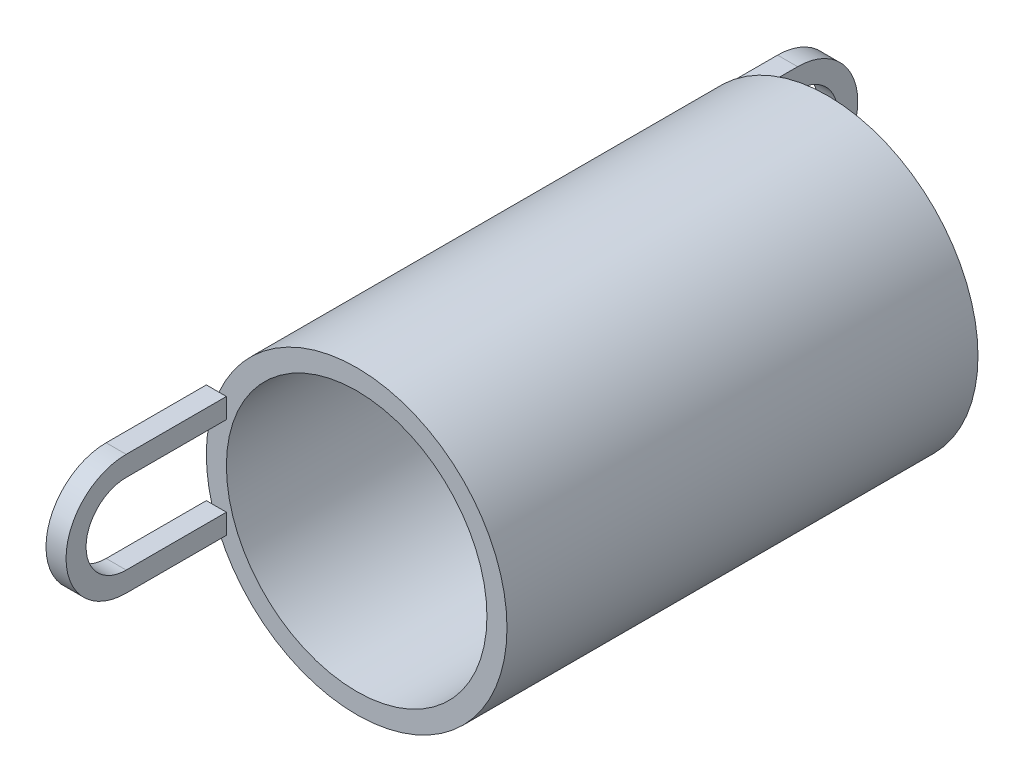
ISO-10303-21;
HEADER;
FILE_DESCRIPTION(('STEP AP214'),'2;1');
FILE_NAME('part.step','',(''),(''),'','','');
FILE_SCHEMA(('AUTOMOTIVE_DESIGN { 1 0 10303 214 1 1 1 1 }'));
ENDSEC;
DATA;
#1=APPLICATION_CONTEXT('core data for automotive mechanical design processes');
#2=APPLICATION_PROTOCOL_DEFINITION('international standard','automotive_design',2000,#1);
#3=PRODUCT_CONTEXT('',#1,'mechanical');
#4=PRODUCT('Part','Part','',(#3));
#5=PRODUCT_RELATED_PRODUCT_CATEGORY('part','',(#4));
#6=PRODUCT_DEFINITION_FORMATION('','',#4);
#7=PRODUCT_DEFINITION_CONTEXT('part definition',#1,'design');
#8=PRODUCT_DEFINITION('design','',#6,#7);
#9=PRODUCT_DEFINITION_SHAPE('','',#8);
#10=(LENGTH_UNIT() NAMED_UNIT(*) SI_UNIT(.MILLI.,.METRE.));
#11=(NAMED_UNIT(*) PLANE_ANGLE_UNIT() SI_UNIT($,.RADIAN.));
#12=(NAMED_UNIT(*) SI_UNIT($,.STERADIAN.) SOLID_ANGLE_UNIT());
#13=UNCERTAINTY_MEASURE_WITH_UNIT(LENGTH_MEASURE(1.E-05),#10,'distance_accuracy_value','');
#14=(GEOMETRIC_REPRESENTATION_CONTEXT(3) GLOBAL_UNCERTAINTY_ASSIGNED_CONTEXT((#13)) GLOBAL_UNIT_ASSIGNED_CONTEXT((#10,
#11,#12)) REPRESENTATION_CONTEXT('',''));
#15=CARTESIAN_POINT('',(0.,0.,0.));
#16=DIRECTION('',(0.,0.,1.));
#17=DIRECTION('',(1.,0.,0.));
#18=AXIS2_PLACEMENT_3D('',#15,#16,#17);
#19=CARTESIAN_POINT('',(0.,0.,23.5));
#20=DIRECTION('',(0.,0.,1.));
#21=DIRECTION('',(1.,0.,0.));
#22=AXIS2_PLACEMENT_3D('',#19,#20,#21);
#23=PLANE('',#22);
#24=CARTESIAN_POINT('',(0.,0.,23.5));
#25=DIRECTION('',(0.,0.,1.));
#26=DIRECTION('',(1.,0.,0.));
#27=AXIS2_PLACEMENT_3D('',#24,#25,#26);
#28=CIRCLE('',#27,6.5);
#29=CARTESIAN_POINT('',(6.5,0.,23.5));
#30=VERTEX_POINT('',#29);
#31=EDGE_CURVE('E268',#30,#30,#28,.T.);
#32=ORIENTED_EDGE('',*,*,#31,.F.);
#33=EDGE_LOOP('',(#32));
#34=FACE_BOUND('',#33,.T.);
#35=DIRECTION('',(0.,1.,0.));
#36=VECTOR('',#35,1.);
#37=CARTESIAN_POINT('',(-6.5,1.99999999999999,23.5));
#38=LINE('',#37,#36);
#39=CARTESIAN_POINT('',(-6.5,2.,23.5));
#40=VERTEX_POINT('',#39);
#41=CARTESIAN_POINT('',(-6.5,3.,23.5));
#42=VERTEX_POINT('',#41);
#43=EDGE_CURVE('E49',#40,#42,#38,.T.);
#44=ORIENTED_EDGE('',*,*,#43,.F.);
#45=DIRECTION('',(-1.,0.,0.));
#46=VECTOR('',#45,1.);
#47=CARTESIAN_POINT('',(-6.5,1.99999999999999,23.5));
#48=LINE('',#47,#46);
#49=CARTESIAN_POINT('',(-7.22841614740048,1.99999999999999,23.5));
#50=VERTEX_POINT('',#49);
#51=EDGE_CURVE('E527',#40,#50,#48,.T.);
#52=ORIENTED_EDGE('',*,*,#51,.T.);
#53=CARTESIAN_POINT('',(0.,0.,23.5));
#54=DIRECTION('',(0.,0.,1.));
#55=DIRECTION('',(1.,0.,0.));
#56=AXIS2_PLACEMENT_3D('',#53,#54,#55);
#57=CIRCLE('',#56,7.5);
#58=CARTESIAN_POINT('',(-7.22841614740048,-2.,23.5));
#59=VERTEX_POINT('',#58);
#60=EDGE_CURVE('E41',#50,#59,#57,.T.);
#61=ORIENTED_EDGE('',*,*,#60,.T.);
#62=DIRECTION('',(-1.,0.,0.));
#63=VECTOR('',#62,1.);
#64=CARTESIAN_POINT('',(-6.5,-2.,23.5));
#65=LINE('',#64,#63);
#66=CARTESIAN_POINT('',(-6.5,-2.,23.5));
#67=VERTEX_POINT('',#66);
#68=EDGE_CURVE('E535',#67,#59,#65,.T.);
#69=ORIENTED_EDGE('',*,*,#68,.F.);
#70=DIRECTION('',(0.,1.,0.));
#71=VECTOR('',#70,1.);
#72=CARTESIAN_POINT('',(-6.5,-3.00000000000001,23.5));
#73=LINE('',#72,#71);
#74=CARTESIAN_POINT('',(-6.5,-3.00000000000001,23.5));
#75=VERTEX_POINT('',#74);
#76=EDGE_CURVE('E183',#75,#67,#73,.T.);
#77=ORIENTED_EDGE('',*,*,#76,.F.);
#78=DIRECTION('',(-1.,0.,0.));
#79=VECTOR('',#78,1.);
#80=CARTESIAN_POINT('',(-6.5,-3.00000000000001,23.5));
#81=LINE('',#80,#79);
#82=CARTESIAN_POINT('',(-6.87386354243376,-3.00000000000001,23.5));
#83=VERTEX_POINT('',#82);
#84=EDGE_CURVE('E180',#75,#83,#81,.T.);
#85=ORIENTED_EDGE('',*,*,#84,.T.);
#86=CARTESIAN_POINT('',(-6.87386354243376,3.,23.5));
#87=VERTEX_POINT('',#86);
#88=EDGE_CURVE('E42',#83,#87,#57,.T.);
#89=ORIENTED_EDGE('',*,*,#88,.T.);
#90=DIRECTION('',(-1.,0.,0.));
#91=VECTOR('',#90,1.);
#92=CARTESIAN_POINT('',(-6.5,3.,23.5));
#93=LINE('',#92,#91);
#94=EDGE_CURVE('E54',#42,#87,#93,.T.);
#95=ORIENTED_EDGE('',*,*,#94,.F.);
#96=EDGE_LOOP('',(#44,#52,#61,#69,#77,#85,#89,#95));
#97=FACE_BOUND('',#96,.T.);
#98=ADVANCED_FACE('F32',(#34,#97),#23,.T.);
#99=CARTESIAN_POINT('',(0.,0.,0.));
#100=DIRECTION('',(0.,0.,1.));
#101=DIRECTION('',(1.,0.,0.));
#102=AXIS2_PLACEMENT_3D('',#99,#100,#101);
#103=PLANE('',#102);
#104=CARTESIAN_POINT('',(0.,0.,0.));
#105=DIRECTION('',(0.,0.,1.));
#106=DIRECTION('',(1.,0.,0.));
#107=AXIS2_PLACEMENT_3D('',#104,#105,#106);
#108=CIRCLE('',#107,6.5);
#109=CARTESIAN_POINT('',(6.5,0.,0.));
#110=VERTEX_POINT('',#109);
#111=EDGE_CURVE('E267',#110,#110,#108,.T.);
#112=ORIENTED_EDGE('',*,*,#111,.T.);
#113=EDGE_LOOP('',(#112));
#114=FACE_BOUND('',#113,.T.);
#115=DIRECTION('',(-1.,0.,0.));
#116=VECTOR('',#115,1.);
#117=CARTESIAN_POINT('',(-6.5,-2.,0.));
#118=LINE('',#117,#116);
#119=CARTESIAN_POINT('',(-6.5,-2.,0.));
#120=VERTEX_POINT('',#119);
#121=CARTESIAN_POINT('',(-7.22841614740048,-2.,0.));
#122=VERTEX_POINT('',#121);
#123=EDGE_CURVE('E261',#120,#122,#118,.T.);
#124=ORIENTED_EDGE('',*,*,#123,.T.);
#125=CARTESIAN_POINT('',(0.,0.,0.));
#126=DIRECTION('',(0.,0.,1.));
#127=DIRECTION('',(1.,0.,0.));
#128=AXIS2_PLACEMENT_3D('',#125,#126,#127);
#129=CIRCLE('',#128,7.5);
#130=CARTESIAN_POINT('',(-7.22841614740048,2.,0.));
#131=VERTEX_POINT('',#130);
#132=EDGE_CURVE('E560',#131,#122,#129,.T.);
#133=ORIENTED_EDGE('',*,*,#132,.F.);
#134=DIRECTION('',(-1.,0.,0.));
#135=VECTOR('',#134,1.);
#136=CARTESIAN_POINT('',(-6.5,2.,0.));
#137=LINE('',#136,#135);
#138=CARTESIAN_POINT('',(-6.5,2.,0.));
#139=VERTEX_POINT('',#138);
#140=EDGE_CURVE('E245',#139,#131,#137,.T.);
#141=ORIENTED_EDGE('',*,*,#140,.F.);
#142=DIRECTION('',(0.,-1.,0.));
#143=VECTOR('',#142,1.);
#144=CARTESIAN_POINT('',(-6.5,3.,0.));
#145=LINE('',#144,#143);
#146=CARTESIAN_POINT('',(-6.5,3.,0.));
#147=VERTEX_POINT('',#146);
#148=EDGE_CURVE('E221',#147,#139,#145,.T.);
#149=ORIENTED_EDGE('',*,*,#148,.F.);
#150=DIRECTION('',(-1.,0.,0.));
#151=VECTOR('',#150,1.);
#152=CARTESIAN_POINT('',(-6.5,3.,0.));
#153=LINE('',#152,#151);
#154=CARTESIAN_POINT('',(-6.87386354243376,3.,0.));
#155=VERTEX_POINT('',#154);
#156=EDGE_CURVE('E248',#147,#155,#153,.T.);
#157=ORIENTED_EDGE('',*,*,#156,.T.);
#158=CARTESIAN_POINT('',(-6.87386354243376,-3.,0.));
#159=VERTEX_POINT('',#158);
#160=EDGE_CURVE('E271',#159,#155,#129,.T.);
#161=ORIENTED_EDGE('',*,*,#160,.F.);
#162=DIRECTION('',(-1.,0.,0.));
#163=VECTOR('',#162,1.);
#164=CARTESIAN_POINT('',(-6.5,-3.,0.));
#165=LINE('',#164,#163);
#166=CARTESIAN_POINT('',(-6.5,-3.,0.));
#167=VERTEX_POINT('',#166);
#168=EDGE_CURVE('E258',#167,#159,#165,.T.);
#169=ORIENTED_EDGE('',*,*,#168,.F.);
#170=DIRECTION('',(0.,-1.,0.));
#171=VECTOR('',#170,1.);
#172=CARTESIAN_POINT('',(-6.5,-3.,0.));
#173=LINE('',#172,#171);
#174=EDGE_CURVE('E213',#120,#167,#173,.T.);
#175=ORIENTED_EDGE('',*,*,#174,.F.);
#176=EDGE_LOOP('',(#124,#133,#141,#149,#157,#161,#169,#175));
#177=FACE_BOUND('',#176,.T.);
#178=ADVANCED_FACE('F275',(#114,#177),#103,.F.);
#179=CARTESIAN_POINT('',(0.,0.,23.5));
#180=DIRECTION('',(0.,0.,-1.));
#181=DIRECTION('',(-1.,0.,0.));
#182=AXIS2_PLACEMENT_3D('',#179,#180,#181);
#183=CYLINDRICAL_SURFACE('',#182,7.5);
#184=EDGE_CURVE('E11',#87,#50,#57,.T.);
#185=ORIENTED_EDGE('',*,*,#184,.F.);
#186=ORIENTED_EDGE('',*,*,#88,.F.);
#187=EDGE_CURVE('E558',#59,#83,#57,.T.);
#188=ORIENTED_EDGE('',*,*,#187,.F.);
#189=ORIENTED_EDGE('',*,*,#60,.F.);
#190=EDGE_LOOP('',(#185,#186,#188,#189));
#191=FACE_BOUND('',#190,.T.);
#192=EDGE_CURVE('E36',#155,#131,#129,.T.);
#193=ORIENTED_EDGE('',*,*,#192,.T.);
#194=ORIENTED_EDGE('',*,*,#132,.T.);
#195=EDGE_CURVE('E564',#122,#159,#129,.T.);
#196=ORIENTED_EDGE('',*,*,#195,.T.);
#197=ORIENTED_EDGE('',*,*,#160,.T.);
#198=EDGE_LOOP('',(#193,#194,#196,#197));
#199=FACE_BOUND('',#198,.T.);
#200=ADVANCED_FACE('F34',(#191,#199),#183,.T.);
#201=CARTESIAN_POINT('',(0.,0.,23.5));
#202=DIRECTION('',(0.,0.,-1.));
#203=DIRECTION('',(-1.,0.,0.));
#204=AXIS2_PLACEMENT_3D('',#201,#202,#203);
#205=CYLINDRICAL_SURFACE('',#204,6.5);
#206=ORIENTED_EDGE('',*,*,#31,.T.);
#207=EDGE_LOOP('',(#206));
#208=FACE_BOUND('',#207,.T.);
#209=ORIENTED_EDGE('',*,*,#111,.F.);
#210=EDGE_LOOP('',(#209));
#211=FACE_BOUND('',#210,.T.);
#212=ADVANCED_FACE('F278',(#208,#211),#205,.F.);
#213=CARTESIAN_POINT('',(-6.5,0.,-5.));
#214=DIRECTION('',(-1.,0.,0.));
#215=DIRECTION('',(0.,0.,1.));
#216=AXIS2_PLACEMENT_3D('',#213,#214,#215);
#217=CYLINDRICAL_SURFACE('',#216,2.);
#218=CARTESIAN_POINT('',(-7.5,0.,-5.));
#219=DIRECTION('',(-1.,0.,0.));
#220=DIRECTION('',(0.,0.,-1.));
#221=AXIS2_PLACEMENT_3D('',#218,#219,#220);
#222=CIRCLE('',#221,2.);
#223=CARTESIAN_POINT('',(-7.5,2.,-5.));
#224=VERTEX_POINT('',#223);
#225=CARTESIAN_POINT('',(-7.5,-2.,-5.));
#226=VERTEX_POINT('',#225);
#227=EDGE_CURVE('E198',#224,#226,#222,.T.);
#228=ORIENTED_EDGE('',*,*,#227,.T.);
#229=DIRECTION('',(-1.,0.,0.));
#230=VECTOR('',#229,1.);
#231=CARTESIAN_POINT('',(-6.5,-2.,-5.));
#232=LINE('',#231,#230);
#233=CARTESIAN_POINT('',(-6.5,-2.,-5.));
#234=VERTEX_POINT('',#233);
#235=EDGE_CURVE('E264',#234,#226,#232,.T.);
#236=ORIENTED_EDGE('',*,*,#235,.F.);
#237=CARTESIAN_POINT('',(-6.5,0.,-5.));
#238=DIRECTION('',(-1.,0.,0.));
#239=DIRECTION('',(0.,0.,-1.));
#240=AXIS2_PLACEMENT_3D('',#237,#238,#239);
#241=CIRCLE('',#240,2.);
#242=CARTESIAN_POINT('',(-6.5,2.,-5.));
#243=VERTEX_POINT('',#242);
#244=EDGE_CURVE('E207',#243,#234,#241,.T.);
#245=ORIENTED_EDGE('',*,*,#244,.F.);
#246=DIRECTION('',(-1.,0.,0.));
#247=VECTOR('',#246,1.);
#248=CARTESIAN_POINT('',(-6.5,2.,-5.));
#249=LINE('',#248,#247);
#250=EDGE_CURVE('E224',#243,#224,#249,.T.);
#251=ORIENTED_EDGE('',*,*,#250,.T.);
#252=EDGE_LOOP('',(#228,#236,#245,#251));
#253=FACE_BOUND('',#252,.T.);
#254=ADVANCED_FACE('F280',(#253),#217,.F.);
#255=CARTESIAN_POINT('',(-6.5,-2.,-5.));
#256=DIRECTION('',(0.,-1.,0.));
#257=DIRECTION('',(0.,0.,-1.));
#258=AXIS2_PLACEMENT_3D('',#255,#256,#257);
#259=PLANE('',#258);
#260=DIRECTION('',(0.,0.,1.));
#261=VECTOR('',#260,1.);
#262=CARTESIAN_POINT('',(-7.5,-2.,-5.));
#263=LINE('',#262,#261);
#264=CARTESIAN_POINT('',(-7.5,-2.,0.));
#265=VERTEX_POINT('',#264);
#266=EDGE_CURVE('E201',#226,#265,#263,.T.);
#267=ORIENTED_EDGE('',*,*,#266,.T.);
#268=EDGE_CURVE('E260',#122,#265,#118,.T.);
#269=ORIENTED_EDGE('',*,*,#268,.F.);
#270=ORIENTED_EDGE('',*,*,#123,.F.);
#271=DIRECTION('',(0.,0.,1.));
#272=VECTOR('',#271,1.);
#273=CARTESIAN_POINT('',(-6.5,-2.,-5.));
#274=LINE('',#273,#272);
#275=EDGE_CURVE('E210',#234,#120,#274,.T.);
#276=ORIENTED_EDGE('',*,*,#275,.F.);
#277=ORIENTED_EDGE('',*,*,#235,.T.);
#278=EDGE_LOOP('',(#267,#269,#270,#276,#277));
#279=FACE_BOUND('',#278,.T.);
#280=ADVANCED_FACE('F287',(#279),#259,.F.);
#281=CARTESIAN_POINT('',(-6.5,-3.,0.));
#282=DIRECTION('',(0.,0.,-1.));
#283=DIRECTION('',(0.,1.,0.));
#284=AXIS2_PLACEMENT_3D('',#281,#282,#283);
#285=PLANE('',#284);
#286=CARTESIAN_POINT('',(-7.5,-3.,0.));
#287=VERTEX_POINT('',#286);
#288=EDGE_CURVE('E257',#159,#287,#165,.T.);
#289=ORIENTED_EDGE('',*,*,#288,.F.);
#290=ORIENTED_EDGE('',*,*,#195,.F.);
#291=ORIENTED_EDGE('',*,*,#268,.T.);
#292=DIRECTION('',(0.,-1.,0.));
#293=VECTOR('',#292,1.);
#294=CARTESIAN_POINT('',(-7.5,-3.,0.));
#295=LINE('',#294,#293);
#296=EDGE_CURVE('E228',#265,#287,#295,.T.);
#297=ORIENTED_EDGE('',*,*,#296,.T.);
#298=EDGE_LOOP('',(#289,#290,#291,#297));
#299=FACE_BOUND('',#298,.T.);
#300=ADVANCED_FACE('F321',(#299),#285,.F.);
#301=CARTESIAN_POINT('',(-6.5,-3.,-5.));
#302=DIRECTION('',(0.,1.,0.));
#303=DIRECTION('',(0.,0.,1.));
#304=AXIS2_PLACEMENT_3D('',#301,#302,#303);
#305=PLANE('',#304);
#306=DIRECTION('',(0.,0.,-1.));
#307=VECTOR('',#306,1.);
#308=CARTESIAN_POINT('',(-7.5,-3.,-5.));
#309=LINE('',#308,#307);
#310=CARTESIAN_POINT('',(-7.5,-3.,-5.));
#311=VERTEX_POINT('',#310);
#312=EDGE_CURVE('E231',#287,#311,#309,.T.);
#313=ORIENTED_EDGE('',*,*,#312,.T.);
#314=DIRECTION('',(-1.,0.,0.));
#315=VECTOR('',#314,1.);
#316=CARTESIAN_POINT('',(-6.5,-3.,-5.));
#317=LINE('',#316,#315);
#318=CARTESIAN_POINT('',(-6.5,-3.,-5.));
#319=VERTEX_POINT('',#318);
#320=EDGE_CURVE('E254',#319,#311,#317,.T.);
#321=ORIENTED_EDGE('',*,*,#320,.F.);
#322=DIRECTION('',(0.,0.,-1.));
#323=VECTOR('',#322,1.);
#324=CARTESIAN_POINT('',(-6.5,-3.,-5.));
#325=LINE('',#324,#323);
#326=EDGE_CURVE('E215',#167,#319,#325,.T.);
#327=ORIENTED_EDGE('',*,*,#326,.F.);
#328=ORIENTED_EDGE('',*,*,#168,.T.);
#329=ORIENTED_EDGE('',*,*,#288,.T.);
#330=EDGE_LOOP('',(#313,#321,#327,#328,#329));
#331=FACE_BOUND('',#330,.T.);
#332=ADVANCED_FACE('F331',(#331),#305,.F.);
#333=CARTESIAN_POINT('',(-6.5,0.,-5.));
#334=DIRECTION('',(-1.,0.,0.));
#335=DIRECTION('',(0.,0.,1.));
#336=AXIS2_PLACEMENT_3D('',#333,#334,#335);
#337=CYLINDRICAL_SURFACE('',#336,3.);
#338=CARTESIAN_POINT('',(-7.5,0.,-5.));
#339=DIRECTION('',(1.,0.,0.));
#340=DIRECTION('',(0.,0.,-1.));
#341=AXIS2_PLACEMENT_3D('',#338,#339,#340);
#342=CIRCLE('',#341,3.);
#343=CARTESIAN_POINT('',(-7.5,3.,-5.));
#344=VERTEX_POINT('',#343);
#345=EDGE_CURVE('E233',#311,#344,#342,.T.);
#346=ORIENTED_EDGE('',*,*,#345,.T.);
#347=DIRECTION('',(-1.,0.,0.));
#348=VECTOR('',#347,1.);
#349=CARTESIAN_POINT('',(-6.5,3.,-5.));
#350=LINE('',#349,#348);
#351=CARTESIAN_POINT('',(-6.5,3.,-5.));
#352=VERTEX_POINT('',#351);
#353=EDGE_CURVE('E251',#352,#344,#350,.T.);
#354=ORIENTED_EDGE('',*,*,#353,.F.);
#355=CARTESIAN_POINT('',(-6.5,0.,-5.));
#356=DIRECTION('',(1.,0.,0.));
#357=DIRECTION('',(0.,0.,-1.));
#358=AXIS2_PLACEMENT_3D('',#355,#356,#357);
#359=CIRCLE('',#358,3.);
#360=EDGE_CURVE('E217',#319,#352,#359,.T.);
#361=ORIENTED_EDGE('',*,*,#360,.F.);
#362=ORIENTED_EDGE('',*,*,#320,.T.);
#363=EDGE_LOOP('',(#346,#354,#361,#362));
#364=FACE_BOUND('',#363,.T.);
#365=ADVANCED_FACE('F341',(#364),#337,.T.);
#366=CARTESIAN_POINT('',(-6.5,3.,-5.));
#367=DIRECTION('',(0.,-1.,0.));
#368=DIRECTION('',(0.,0.,-1.));
#369=AXIS2_PLACEMENT_3D('',#366,#367,#368);
#370=PLANE('',#369);
#371=DIRECTION('',(0.,0.,1.));
#372=VECTOR('',#371,1.);
#373=CARTESIAN_POINT('',(-7.5,3.,-5.));
#374=LINE('',#373,#372);
#375=CARTESIAN_POINT('',(-7.5,3.,0.));
#376=VERTEX_POINT('',#375);
#377=EDGE_CURVE('E235',#344,#376,#374,.T.);
#378=ORIENTED_EDGE('',*,*,#377,.T.);
#379=EDGE_CURVE('E247',#155,#376,#153,.T.);
#380=ORIENTED_EDGE('',*,*,#379,.F.);
#381=ORIENTED_EDGE('',*,*,#156,.F.);
#382=DIRECTION('',(0.,0.,1.));
#383=VECTOR('',#382,1.);
#384=CARTESIAN_POINT('',(-6.5,3.,-5.));
#385=LINE('',#384,#383);
#386=EDGE_CURVE('E219',#352,#147,#385,.T.);
#387=ORIENTED_EDGE('',*,*,#386,.F.);
#388=ORIENTED_EDGE('',*,*,#353,.T.);
#389=EDGE_LOOP('',(#378,#380,#381,#387,#388));
#390=FACE_BOUND('',#389,.T.);
#391=ADVANCED_FACE('F351',(#390),#370,.F.);
#392=CARTESIAN_POINT('',(-6.5,3.,0.));
#393=DIRECTION('',(0.,0.,-1.));
#394=DIRECTION('',(0.,1.,0.));
#395=AXIS2_PLACEMENT_3D('',#392,#393,#394);
#396=PLANE('',#395);
#397=CARTESIAN_POINT('',(-7.5,2.,0.));
#398=VERTEX_POINT('',#397);
#399=EDGE_CURVE('E244',#131,#398,#137,.T.);
#400=ORIENTED_EDGE('',*,*,#399,.F.);
#401=ORIENTED_EDGE('',*,*,#192,.F.);
#402=ORIENTED_EDGE('',*,*,#379,.T.);
#403=DIRECTION('',(0.,-1.,0.));
#404=VECTOR('',#403,1.);
#405=CARTESIAN_POINT('',(-7.5,3.,0.));
#406=LINE('',#405,#404);
#407=EDGE_CURVE('E238',#376,#398,#406,.T.);
#408=ORIENTED_EDGE('',*,*,#407,.T.);
#409=EDGE_LOOP('',(#400,#401,#402,#408));
#410=FACE_BOUND('',#409,.T.);
#411=ADVANCED_FACE('F361',(#410),#396,.F.);
#412=CARTESIAN_POINT('',(-6.5,2.,-5.));
#413=DIRECTION('',(0.,1.,0.));
#414=DIRECTION('',(0.,0.,1.));
#415=AXIS2_PLACEMENT_3D('',#412,#413,#414);
#416=PLANE('',#415);
#417=DIRECTION('',(0.,0.,-1.));
#418=VECTOR('',#417,1.);
#419=CARTESIAN_POINT('',(-7.5,2.,-5.));
#420=LINE('',#419,#418);
#421=EDGE_CURVE('E211',#398,#224,#420,.T.);
#422=ORIENTED_EDGE('',*,*,#421,.T.);
#423=ORIENTED_EDGE('',*,*,#250,.F.);
#424=DIRECTION('',(0.,0.,-1.));
#425=VECTOR('',#424,1.);
#426=CARTESIAN_POINT('',(-6.5,2.,-5.));
#427=LINE('',#426,#425);
#428=EDGE_CURVE('E223',#139,#243,#427,.T.);
#429=ORIENTED_EDGE('',*,*,#428,.F.);
#430=ORIENTED_EDGE('',*,*,#140,.T.);
#431=ORIENTED_EDGE('',*,*,#399,.T.);
#432=EDGE_LOOP('',(#422,#423,#429,#430,#431));
#433=FACE_BOUND('',#432,.T.);
#434=ADVANCED_FACE('F371',(#433),#416,.F.);
#435=CARTESIAN_POINT('',(-6.5,0.,-5.));
#436=DIRECTION('',(1.,0.,0.));
#437=DIRECTION('',(0.,0.,-1.));
#438=AXIS2_PLACEMENT_3D('',#435,#436,#437);
#439=PLANE('',#438);
#440=ORIENTED_EDGE('',*,*,#244,.T.);
#441=ORIENTED_EDGE('',*,*,#275,.T.);
#442=ORIENTED_EDGE('',*,*,#174,.T.);
#443=ORIENTED_EDGE('',*,*,#326,.T.);
#444=ORIENTED_EDGE('',*,*,#360,.T.);
#445=ORIENTED_EDGE('',*,*,#386,.T.);
#446=ORIENTED_EDGE('',*,*,#148,.T.);
#447=ORIENTED_EDGE('',*,*,#428,.T.);
#448=EDGE_LOOP('',(#440,#441,#442,#443,#444,#445,#446,#447));
#449=FACE_BOUND('',#448,.T.);
#450=ADVANCED_FACE('F381',(#449),#439,.T.);
#451=CARTESIAN_POINT('',(-7.5,0.,-5.));
#452=DIRECTION('',(1.,0.,0.));
#453=DIRECTION('',(0.,0.,-1.));
#454=AXIS2_PLACEMENT_3D('',#451,#452,#453);
#455=PLANE('',#454);
#456=ORIENTED_EDGE('',*,*,#227,.F.);
#457=ORIENTED_EDGE('',*,*,#421,.F.);
#458=ORIENTED_EDGE('',*,*,#407,.F.);
#459=ORIENTED_EDGE('',*,*,#377,.F.);
#460=ORIENTED_EDGE('',*,*,#345,.F.);
#461=ORIENTED_EDGE('',*,*,#312,.F.);
#462=ORIENTED_EDGE('',*,*,#296,.F.);
#463=ORIENTED_EDGE('',*,*,#266,.F.);
#464=EDGE_LOOP('',(#456,#457,#458,#459,#460,#461,#462,#463));
#465=FACE_BOUND('',#464,.T.);
#466=ADVANCED_FACE('F391',(#465),#455,.F.);
#467=CARTESIAN_POINT('',(-6.5,0.,28.5));
#468=DIRECTION('',(-1.,0.,0.));
#469=DIRECTION('',(0.,0.,1.));
#470=AXIS2_PLACEMENT_3D('',#467,#468,#469);
#471=CYLINDRICAL_SURFACE('',#470,3.);
#472=CARTESIAN_POINT('',(-7.5,0.,28.5));
#473=DIRECTION('',(1.,0.,0.));
#474=DIRECTION('',(0.,0.,1.));
#475=AXIS2_PLACEMENT_3D('',#472,#473,#474);
#476=CIRCLE('',#475,3.);
#477=CARTESIAN_POINT('',(-7.5,2.99999999999999,28.5));
#478=VERTEX_POINT('',#477);
#479=CARTESIAN_POINT('',(-7.5,-3.,28.5));
#480=VERTEX_POINT('',#479);
#481=EDGE_CURVE('E197',#478,#480,#476,.T.);
#482=ORIENTED_EDGE('',*,*,#481,.T.);
#483=DIRECTION('',(-1.,0.,0.));
#484=VECTOR('',#483,1.);
#485=CARTESIAN_POINT('',(-6.5,-3.,28.5));
#486=LINE('',#485,#484);
#487=CARTESIAN_POINT('',(-6.5,-3.,28.5));
#488=VERTEX_POINT('',#487);
#489=EDGE_CURVE('E176',#488,#480,#486,.T.);
#490=ORIENTED_EDGE('',*,*,#489,.F.);
#491=CARTESIAN_POINT('',(-6.5,0.,28.5));
#492=DIRECTION('',(1.,0.,0.));
#493=DIRECTION('',(0.,0.,1.));
#494=AXIS2_PLACEMENT_3D('',#491,#492,#493);
#495=CIRCLE('',#494,3.);
#496=CARTESIAN_POINT('',(-6.5,2.99999999999999,28.5));
#497=VERTEX_POINT('',#496);
#498=EDGE_CURVE('E184',#497,#488,#495,.T.);
#499=ORIENTED_EDGE('',*,*,#498,.F.);
#500=DIRECTION('',(-1.,0.,0.));
#501=VECTOR('',#500,1.);
#502=CARTESIAN_POINT('',(-6.5,2.99999999999999,28.5));
#503=LINE('',#502,#501);
#504=EDGE_CURVE('E522',#497,#478,#503,.T.);
#505=ORIENTED_EDGE('',*,*,#504,.T.);
#506=EDGE_LOOP('',(#482,#490,#499,#505));
#507=FACE_BOUND('',#506,.T.);
#508=ADVANCED_FACE('F195',(#507),#471,.T.);
#509=CARTESIAN_POINT('',(-6.5,-3.,28.5));
#510=DIRECTION('',(0.,1.,0.));
#511=DIRECTION('',(0.,0.,1.));
#512=AXIS2_PLACEMENT_3D('',#509,#510,#511);
#513=PLANE('',#512);
#514=DIRECTION('',(0.,0.,-1.));
#515=VECTOR('',#514,1.);
#516=CARTESIAN_POINT('',(-7.5,-3.,28.5));
#517=LINE('',#516,#515);
#518=CARTESIAN_POINT('',(-7.5,-3.00000000000001,23.5));
#519=VERTEX_POINT('',#518);
#520=EDGE_CURVE('E502',#480,#519,#517,.T.);
#521=ORIENTED_EDGE('',*,*,#520,.T.);
#522=EDGE_CURVE('E203',#83,#519,#81,.T.);
#523=ORIENTED_EDGE('',*,*,#522,.F.);
#524=ORIENTED_EDGE('',*,*,#84,.F.);
#525=DIRECTION('',(0.,0.,-1.));
#526=VECTOR('',#525,1.);
#527=CARTESIAN_POINT('',(-6.5,-3.,28.5));
#528=LINE('',#527,#526);
#529=EDGE_CURVE('E171',#488,#75,#528,.T.);
#530=ORIENTED_EDGE('',*,*,#529,.F.);
#531=ORIENTED_EDGE('',*,*,#489,.T.);
#532=EDGE_LOOP('',(#521,#523,#524,#530,#531));
#533=FACE_BOUND('',#532,.T.);
#534=ADVANCED_FACE('F174',(#533),#513,.F.);
#535=CARTESIAN_POINT('',(-6.5,-3.00000000000001,23.5));
#536=DIRECTION('',(0.,0.,1.));
#537=DIRECTION('',(1.,0.,0.));
#538=AXIS2_PLACEMENT_3D('',#535,#536,#537);
#539=PLANE('',#538);
#540=CARTESIAN_POINT('',(-7.5,-2.,23.5));
#541=VERTEX_POINT('',#540);
#542=EDGE_CURVE('E534',#59,#541,#65,.T.);
#543=ORIENTED_EDGE('',*,*,#542,.F.);
#544=ORIENTED_EDGE('',*,*,#187,.T.);
#545=ORIENTED_EDGE('',*,*,#522,.T.);
#546=DIRECTION('',(0.,1.,0.));
#547=VECTOR('',#546,1.);
#548=CARTESIAN_POINT('',(-7.5,-3.00000000000001,23.5));
#549=LINE('',#548,#547);
#550=EDGE_CURVE('E504',#519,#541,#549,.T.);
#551=ORIENTED_EDGE('',*,*,#550,.T.);
#552=EDGE_LOOP('',(#543,#544,#545,#551));
#553=FACE_BOUND('',#552,.T.);
#554=ADVANCED_FACE('F418',(#553),#539,.F.);
#555=CARTESIAN_POINT('',(-6.5,-2.00000000000001,28.5));
#556=DIRECTION('',(0.,-1.,0.));
#557=DIRECTION('',(0.,0.,-1.));
#558=AXIS2_PLACEMENT_3D('',#555,#556,#557);
#559=PLANE('',#558);
#560=DIRECTION('',(0.,0.,1.));
#561=VECTOR('',#560,1.);
#562=CARTESIAN_POINT('',(-7.5,-2.00000000000001,28.5));
#563=LINE('',#562,#561);
#564=CARTESIAN_POINT('',(-7.5,-2.,28.5));
#565=VERTEX_POINT('',#564);
#566=EDGE_CURVE('E511',#541,#565,#563,.T.);
#567=ORIENTED_EDGE('',*,*,#566,.T.);
#568=DIRECTION('',(-1.,0.,0.));
#569=VECTOR('',#568,1.);
#570=CARTESIAN_POINT('',(-6.5,-2.,28.5));
#571=LINE('',#570,#569);
#572=CARTESIAN_POINT('',(-6.5,-2.,28.5));
#573=VERTEX_POINT('',#572);
#574=EDGE_CURVE('E532',#573,#565,#571,.T.);
#575=ORIENTED_EDGE('',*,*,#574,.F.);
#576=DIRECTION('',(0.,0.,1.));
#577=VECTOR('',#576,1.);
#578=CARTESIAN_POINT('',(-6.5,-2.00000000000001,28.5));
#579=LINE('',#578,#577);
#580=EDGE_CURVE('E552',#67,#573,#579,.T.);
#581=ORIENTED_EDGE('',*,*,#580,.F.);
#582=ORIENTED_EDGE('',*,*,#68,.T.);
#583=ORIENTED_EDGE('',*,*,#542,.T.);
#584=EDGE_LOOP('',(#567,#575,#581,#582,#583));
#585=FACE_BOUND('',#584,.T.);
#586=ADVANCED_FACE('F427',(#585),#559,.F.);
#587=CARTESIAN_POINT('',(-6.5,0.,28.5));
#588=DIRECTION('',(-1.,0.,0.));
#589=DIRECTION('',(0.,0.,1.));
#590=AXIS2_PLACEMENT_3D('',#587,#588,#589);
#591=CYLINDRICAL_SURFACE('',#590,2.);
#592=CARTESIAN_POINT('',(-7.5,0.,28.5));
#593=DIRECTION('',(-1.,0.,0.));
#594=DIRECTION('',(0.,0.,1.));
#595=AXIS2_PLACEMENT_3D('',#592,#593,#594);
#596=CIRCLE('',#595,2.);
#597=CARTESIAN_POINT('',(-7.5,2.,28.5));
#598=VERTEX_POINT('',#597);
#599=EDGE_CURVE('E513',#565,#598,#596,.T.);
#600=ORIENTED_EDGE('',*,*,#599,.T.);
#601=DIRECTION('',(-1.,0.,0.));
#602=VECTOR('',#601,1.);
#603=CARTESIAN_POINT('',(-6.5,2.,28.5));
#604=LINE('',#603,#602);
#605=CARTESIAN_POINT('',(-6.5,2.,28.5));
#606=VERTEX_POINT('',#605);
#607=EDGE_CURVE('E529',#606,#598,#604,.T.);
#608=ORIENTED_EDGE('',*,*,#607,.F.);
#609=CARTESIAN_POINT('',(-6.5,0.,28.5));
#610=DIRECTION('',(-1.,0.,0.));
#611=DIRECTION('',(0.,0.,1.));
#612=AXIS2_PLACEMENT_3D('',#609,#610,#611);
#613=CIRCLE('',#612,2.);
#614=EDGE_CURVE('E550',#573,#606,#613,.T.);
#615=ORIENTED_EDGE('',*,*,#614,.F.);
#616=ORIENTED_EDGE('',*,*,#574,.T.);
#617=EDGE_LOOP('',(#600,#608,#615,#616));
#618=FACE_BOUND('',#617,.T.);
#619=ADVANCED_FACE('F437',(#618),#591,.F.);
#620=CARTESIAN_POINT('',(-6.5,2.,28.5));
#621=DIRECTION('',(0.,1.,0.));
#622=DIRECTION('',(0.,0.,1.));
#623=AXIS2_PLACEMENT_3D('',#620,#621,#622);
#624=PLANE('',#623);
#625=DIRECTION('',(0.,0.,-1.));
#626=VECTOR('',#625,1.);
#627=CARTESIAN_POINT('',(-7.5,2.,28.5));
#628=LINE('',#627,#626);
#629=CARTESIAN_POINT('',(-7.5,1.99999999999999,23.5));
#630=VERTEX_POINT('',#629);
#631=EDGE_CURVE('E515',#598,#630,#628,.T.);
#632=ORIENTED_EDGE('',*,*,#631,.T.);
#633=EDGE_CURVE('E526',#50,#630,#48,.T.);
#634=ORIENTED_EDGE('',*,*,#633,.F.);
#635=ORIENTED_EDGE('',*,*,#51,.F.);
#636=DIRECTION('',(0.,0.,-1.));
#637=VECTOR('',#636,1.);
#638=CARTESIAN_POINT('',(-6.5,2.,28.5));
#639=LINE('',#638,#637);
#640=EDGE_CURVE('E549',#606,#40,#639,.T.);
#641=ORIENTED_EDGE('',*,*,#640,.F.);
#642=ORIENTED_EDGE('',*,*,#607,.T.);
#643=EDGE_LOOP('',(#632,#634,#635,#641,#642));
#644=FACE_BOUND('',#643,.T.);
#645=ADVANCED_FACE('F447',(#644),#624,.F.);
#646=CARTESIAN_POINT('',(-6.5,1.99999999999999,23.5));
#647=DIRECTION('',(0.,0.,1.));
#648=DIRECTION('',(1.,0.,0.));
#649=AXIS2_PLACEMENT_3D('',#646,#647,#648);
#650=PLANE('',#649);
#651=CARTESIAN_POINT('',(-7.5,3.,23.5));
#652=VERTEX_POINT('',#651);
#653=EDGE_CURVE('E524',#87,#652,#93,.T.);
#654=ORIENTED_EDGE('',*,*,#653,.F.);
#655=ORIENTED_EDGE('',*,*,#184,.T.);
#656=ORIENTED_EDGE('',*,*,#633,.T.);
#657=DIRECTION('',(0.,1.,0.));
#658=VECTOR('',#657,1.);
#659=CARTESIAN_POINT('',(-7.5,1.99999999999999,23.5));
#660=LINE('',#659,#658);
#661=EDGE_CURVE('E518',#630,#652,#660,.T.);
#662=ORIENTED_EDGE('',*,*,#661,.T.);
#663=EDGE_LOOP('',(#654,#655,#656,#662));
#664=FACE_BOUND('',#663,.T.);
#665=ADVANCED_FACE('F457',(#664),#650,.F.);
#666=CARTESIAN_POINT('',(-6.5,2.99999999999999,28.5));
#667=DIRECTION('',(0.,-1.,0.));
#668=DIRECTION('',(0.,0.,-1.));
#669=AXIS2_PLACEMENT_3D('',#666,#667,#668);
#670=PLANE('',#669);
#671=DIRECTION('',(0.,0.,1.));
#672=VECTOR('',#671,1.);
#673=CARTESIAN_POINT('',(-7.5,2.99999999999999,28.5));
#674=LINE('',#673,#672);
#675=EDGE_CURVE('E193',#652,#478,#674,.T.);
#676=ORIENTED_EDGE('',*,*,#675,.T.);
#677=ORIENTED_EDGE('',*,*,#504,.F.);
#678=DIRECTION('',(0.,0.,1.));
#679=VECTOR('',#678,1.);
#680=CARTESIAN_POINT('',(-6.5,2.99999999999999,28.5));
#681=LINE('',#680,#679);
#682=EDGE_CURVE('E189',#42,#497,#681,.T.);
#683=ORIENTED_EDGE('',*,*,#682,.F.);
#684=ORIENTED_EDGE('',*,*,#94,.T.);
#685=ORIENTED_EDGE('',*,*,#653,.T.);
#686=EDGE_LOOP('',(#676,#677,#683,#684,#685));
#687=FACE_BOUND('',#686,.T.);
#688=ADVANCED_FACE('F467',(#687),#670,.F.);
#689=CARTESIAN_POINT('',(-6.5,0.,28.5));
#690=DIRECTION('',(-1.,0.,0.));
#691=DIRECTION('',(0.,0.,1.));
#692=AXIS2_PLACEMENT_3D('',#689,#690,#691);
#693=PLANE('',#692);
#694=ORIENTED_EDGE('',*,*,#498,.T.);
#695=ORIENTED_EDGE('',*,*,#529,.T.);
#696=ORIENTED_EDGE('',*,*,#76,.T.);
#697=ORIENTED_EDGE('',*,*,#580,.T.);
#698=ORIENTED_EDGE('',*,*,#614,.T.);
#699=ORIENTED_EDGE('',*,*,#640,.T.);
#700=ORIENTED_EDGE('',*,*,#43,.T.);
#701=ORIENTED_EDGE('',*,*,#682,.T.);
#702=EDGE_LOOP('',(#694,#695,#696,#697,#698,#699,#700,#701));
#703=FACE_BOUND('',#702,.T.);
#704=ADVANCED_FACE('F187',(#703),#693,.F.);
#705=CARTESIAN_POINT('',(-7.5,0.,28.5));
#706=DIRECTION('',(-1.,0.,0.));
#707=DIRECTION('',(0.,0.,1.));
#708=AXIS2_PLACEMENT_3D('',#705,#706,#707);
#709=PLANE('',#708);
#710=ORIENTED_EDGE('',*,*,#481,.F.);
#711=ORIENTED_EDGE('',*,*,#675,.F.);
#712=ORIENTED_EDGE('',*,*,#661,.F.);
#713=ORIENTED_EDGE('',*,*,#631,.F.);
#714=ORIENTED_EDGE('',*,*,#599,.F.);
#715=ORIENTED_EDGE('',*,*,#566,.F.);
#716=ORIENTED_EDGE('',*,*,#550,.F.);
#717=ORIENTED_EDGE('',*,*,#520,.F.);
#718=EDGE_LOOP('',(#710,#711,#712,#713,#714,#715,#716,#717));
#719=FACE_BOUND('',#718,.T.);
#720=ADVANCED_FACE('F486',(#719),#709,.T.);
#721=CLOSED_SHELL('',(#98,#178,#200,#212,#254,#280,#300,#332,#365,#391,#411,#434,#450,#466,#508,
#534,#554,#586,#619,#645,#665,#688,#704,#720));
#722=MANIFOLD_SOLID_BREP('B2',#721);
#723=ADVANCED_BREP_SHAPE_REPRESENTATION('',(#18,#722),#14);
#724=SHAPE_DEFINITION_REPRESENTATION(#9,#723);
ENDSEC;
END-ISO-10303-21;
